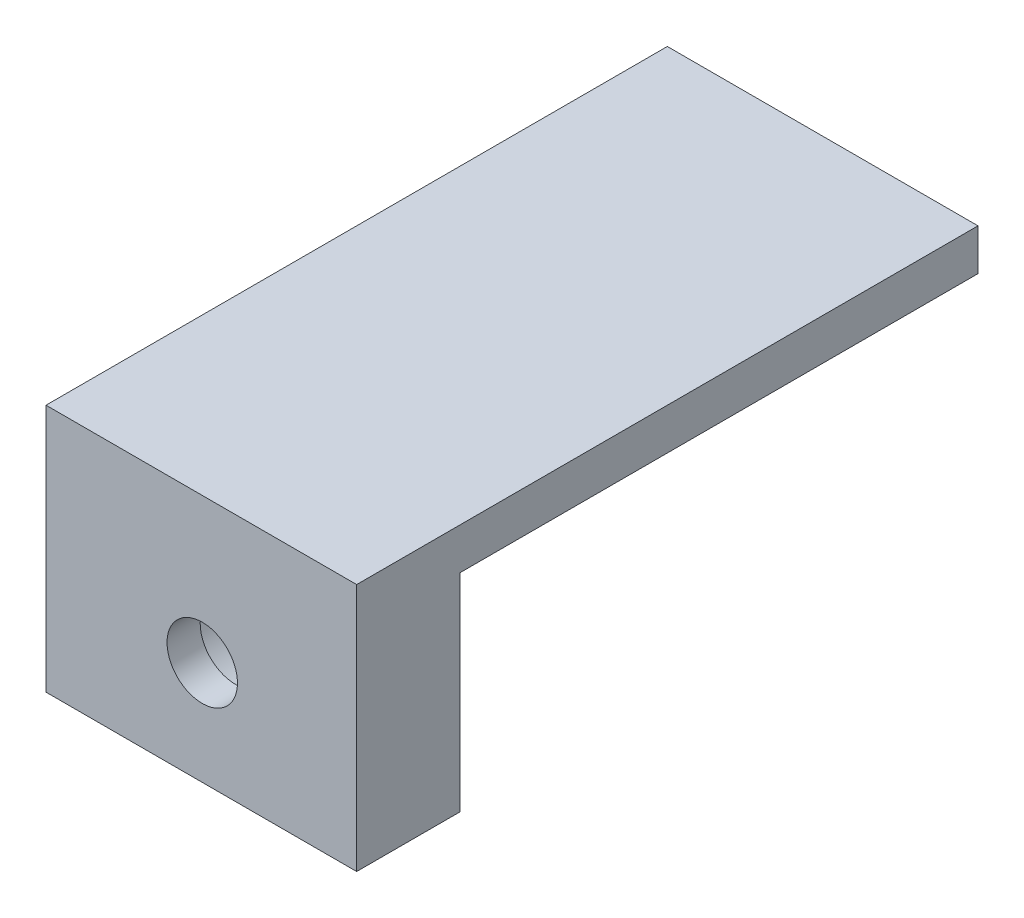
ISO-10303-21;
HEADER;
FILE_DESCRIPTION(('STEP AP214'),'2;1');
FILE_NAME('part.step','',(''),(''),'','','');
FILE_SCHEMA(('AUTOMOTIVE_DESIGN { 1 0 10303 214 1 1 1 1 }'));
ENDSEC;
DATA;
#1=APPLICATION_CONTEXT('core data for automotive mechanical design processes');
#2=APPLICATION_PROTOCOL_DEFINITION('international standard','automotive_design',2000,#1);
#3=PRODUCT_CONTEXT('',#1,'mechanical');
#4=PRODUCT('Part','Part','',(#3));
#5=PRODUCT_RELATED_PRODUCT_CATEGORY('part','',(#4));
#6=PRODUCT_DEFINITION_FORMATION('','',#4);
#7=PRODUCT_DEFINITION_CONTEXT('part definition',#1,'design');
#8=PRODUCT_DEFINITION('design','',#6,#7);
#9=PRODUCT_DEFINITION_SHAPE('','',#8);
#10=(LENGTH_UNIT() NAMED_UNIT(*) SI_UNIT(.MILLI.,.METRE.));
#11=(NAMED_UNIT(*) PLANE_ANGLE_UNIT() SI_UNIT($,.RADIAN.));
#12=(NAMED_UNIT(*) SI_UNIT($,.STERADIAN.) SOLID_ANGLE_UNIT());
#13=UNCERTAINTY_MEASURE_WITH_UNIT(LENGTH_MEASURE(1.E-05),#10,'distance_accuracy_value','');
#14=(GEOMETRIC_REPRESENTATION_CONTEXT(3) GLOBAL_UNCERTAINTY_ASSIGNED_CONTEXT((#13)) GLOBAL_UNIT_ASSIGNED_CONTEXT((#10,
#11,#12)) REPRESENTATION_CONTEXT('',''));
#15=CARTESIAN_POINT('',(0.,0.,0.));
#16=DIRECTION('',(0.,0.,1.));
#17=DIRECTION('',(1.,0.,0.));
#18=AXIS2_PLACEMENT_3D('',#15,#16,#17);
#19=CARTESIAN_POINT('',(0.,0.,0.));
#20=DIRECTION('',(0.,0.,-1.));
#21=DIRECTION('',(-1.,0.,0.));
#22=AXIS2_PLACEMENT_3D('',#19,#20,#21);
#23=PLANE('',#22);
#24=CARTESIAN_POINT('',(7.54432711559616,0.,0.));
#25=DIRECTION('',(0.,0.,-1.));
#26=DIRECTION('',(-1.,0.,0.));
#27=AXIS2_PLACEMENT_3D('',#24,#25,#26);
#28=CIRCLE('',#27,3.25);
#29=CARTESIAN_POINT('',(4.29432711559616,0.,0.));
#30=VERTEX_POINT('',#29);
#31=EDGE_CURVE('E244',#30,#30,#28,.T.);
#32=ORIENTED_EDGE('',*,*,#31,.F.);
#33=EDGE_LOOP('',(#32));
#34=FACE_BOUND('',#33,.T.);
#35=DIRECTION('',(-1.,0.,0.));
#36=VECTOR('',#35,1.);
#37=CARTESIAN_POINT('',(0.,5.,0.));
#38=LINE('',#37,#36);
#39=CARTESIAN_POINT('',(15.,5.,0.));
#40=VERTEX_POINT('',#39);
#41=CARTESIAN_POINT('',(0.,5.,0.));
#42=VERTEX_POINT('',#41);
#43=EDGE_CURVE('E52',#40,#42,#38,.T.);
#44=ORIENTED_EDGE('',*,*,#43,.F.);
#45=DIRECTION('',(0.,1.,0.));
#46=VECTOR('',#45,1.);
#47=CARTESIAN_POINT('',(15.,0.,0.));
#48=LINE('',#47,#46);
#49=CARTESIAN_POINT('',(15.,-5.,0.));
#50=VERTEX_POINT('',#49);
#51=EDGE_CURVE('E138',#50,#40,#48,.T.);
#52=ORIENTED_EDGE('',*,*,#51,.F.);
#53=DIRECTION('',(1.,0.,0.));
#54=VECTOR('',#53,1.);
#55=CARTESIAN_POINT('',(15.,-5.,0.));
#56=LINE('',#55,#54);
#57=CARTESIAN_POINT('',(0.,-5.,0.));
#58=VERTEX_POINT('',#57);
#59=EDGE_CURVE('E108',#58,#50,#56,.T.);
#60=ORIENTED_EDGE('',*,*,#59,.F.);
#61=DIRECTION('',(0.,-1.,0.));
#62=VECTOR('',#61,1.);
#63=CARTESIAN_POINT('',(0.,0.,0.));
#64=LINE('',#63,#62);
#65=EDGE_CURVE('E57',#42,#58,#64,.T.);
#66=ORIENTED_EDGE('',*,*,#65,.F.);
#67=EDGE_LOOP('',(#44,#52,#60,#66));
#68=FACE_BOUND('',#67,.T.);
#69=ADVANCED_FACE('F35',(#34,#68),#23,.T.);
#70=CARTESIAN_POINT('',(0.,0.,5.));
#71=DIRECTION('',(1.,0.,0.));
#72=DIRECTION('',(0.,0.,-1.));
#73=AXIS2_PLACEMENT_3D('',#70,#71,#72);
#74=PLANE('',#73);
#75=DIRECTION('',(0.,-1.,0.));
#76=VECTOR('',#75,1.);
#77=CARTESIAN_POINT('',(0.,0.,5.));
#78=LINE('',#77,#76);
#79=CARTESIAN_POINT('',(0.,7.,5.));
#80=VERTEX_POINT('',#79);
#81=CARTESIAN_POINT('',(0.,-5.,5.));
#82=VERTEX_POINT('',#81);
#83=EDGE_CURVE('E44',#80,#82,#78,.T.);
#84=ORIENTED_EDGE('',*,*,#83,.F.);
#85=DIRECTION('',(0.,0.,1.));
#86=VECTOR('',#85,1.);
#87=CARTESIAN_POINT('',(0.,7.,-25.));
#88=LINE('',#87,#86);
#89=CARTESIAN_POINT('',(0.,7.,-25.));
#90=VERTEX_POINT('',#89);
#91=EDGE_CURVE('E136',#90,#80,#88,.T.);
#92=ORIENTED_EDGE('',*,*,#91,.F.);
#93=DIRECTION('',(0.,1.,0.));
#94=VECTOR('',#93,1.);
#95=CARTESIAN_POINT('',(0.,5.,-25.));
#96=LINE('',#95,#94);
#97=CARTESIAN_POINT('',(0.,5.,-25.));
#98=VERTEX_POINT('',#97);
#99=EDGE_CURVE('E119',#98,#90,#96,.T.);
#100=ORIENTED_EDGE('',*,*,#99,.F.);
#101=DIRECTION('',(0.,0.,1.));
#102=VECTOR('',#101,1.);
#103=CARTESIAN_POINT('',(0.,5.,-25.));
#104=LINE('',#103,#102);
#105=EDGE_CURVE('E128',#98,#42,#104,.T.);
#106=ORIENTED_EDGE('',*,*,#105,.T.);
#107=ORIENTED_EDGE('',*,*,#65,.T.);
#108=DIRECTION('',(0.,0.,-1.));
#109=VECTOR('',#108,1.);
#110=CARTESIAN_POINT('',(0.,-5.,5.));
#111=LINE('',#110,#109);
#112=EDGE_CURVE('E104',#82,#58,#111,.T.);
#113=ORIENTED_EDGE('',*,*,#112,.F.);
#114=EDGE_LOOP('',(#84,#92,#100,#106,#107,#113));
#115=FACE_BOUND('',#114,.T.);
#116=ADVANCED_FACE('F37',(#115),#74,.F.);
#117=CARTESIAN_POINT('',(15.,0.,5.));
#118=DIRECTION('',(-1.,0.,0.));
#119=DIRECTION('',(0.,0.,1.));
#120=AXIS2_PLACEMENT_3D('',#117,#118,#119);
#121=PLANE('',#120);
#122=DIRECTION('',(0.,0.,1.));
#123=VECTOR('',#122,1.);
#124=CARTESIAN_POINT('',(15.,7.,-25.));
#125=LINE('',#124,#123);
#126=CARTESIAN_POINT('',(15.,7.,-25.));
#127=VERTEX_POINT('',#126);
#128=CARTESIAN_POINT('',(15.,7.,5.));
#129=VERTEX_POINT('',#128);
#130=EDGE_CURVE('E93',#127,#129,#125,.T.);
#131=ORIENTED_EDGE('',*,*,#130,.T.);
#132=DIRECTION('',(0.,1.,0.));
#133=VECTOR('',#132,1.);
#134=CARTESIAN_POINT('',(15.,0.,5.));
#135=LINE('',#134,#133);
#136=CARTESIAN_POINT('',(15.,-5.,5.));
#137=VERTEX_POINT('',#136);
#138=EDGE_CURVE('E11',#137,#129,#135,.T.);
#139=ORIENTED_EDGE('',*,*,#138,.F.);
#140=DIRECTION('',(0.,0.,1.));
#141=VECTOR('',#140,1.);
#142=CARTESIAN_POINT('',(15.,-5.,5.));
#143=LINE('',#142,#141);
#144=EDGE_CURVE('E90',#50,#137,#143,.T.);
#145=ORIENTED_EDGE('',*,*,#144,.F.);
#146=ORIENTED_EDGE('',*,*,#51,.T.);
#147=DIRECTION('',(0.,0.,1.));
#148=VECTOR('',#147,1.);
#149=CARTESIAN_POINT('',(15.,5.,-25.));
#150=LINE('',#149,#148);
#151=CARTESIAN_POINT('',(15.,5.,-25.));
#152=VERTEX_POINT('',#151);
#153=EDGE_CURVE('E132',#152,#40,#150,.T.);
#154=ORIENTED_EDGE('',*,*,#153,.F.);
#155=DIRECTION('',(0.,-1.,0.));
#156=VECTOR('',#155,1.);
#157=CARTESIAN_POINT('',(15.,5.,-25.));
#158=LINE('',#157,#156);
#159=EDGE_CURVE('E124',#127,#152,#158,.T.);
#160=ORIENTED_EDGE('',*,*,#159,.F.);
#161=EDGE_LOOP('',(#131,#139,#145,#146,#154,#160));
#162=FACE_BOUND('',#161,.T.);
#163=ADVANCED_FACE('F88',(#162),#121,.F.);
#164=CARTESIAN_POINT('',(0.,0.,5.));
#165=DIRECTION('',(0.,0.,-1.));
#166=DIRECTION('',(-1.,0.,0.));
#167=AXIS2_PLACEMENT_3D('',#164,#165,#166);
#168=PLANE('',#167);
#169=CARTESIAN_POINT('',(7.54432711559616,0.,5.));
#170=DIRECTION('',(0.,0.,-1.));
#171=DIRECTION('',(-1.,0.,0.));
#172=AXIS2_PLACEMENT_3D('',#169,#170,#171);
#173=CIRCLE('',#172,1.7);
#174=CARTESIAN_POINT('',(5.84432711559616,0.,5.));
#175=VERTEX_POINT('',#174);
#176=EDGE_CURVE('E39',#175,#175,#173,.T.);
#177=ORIENTED_EDGE('',*,*,#176,.T.);
#178=EDGE_LOOP('',(#177));
#179=FACE_BOUND('',#178,.T.);
#180=ORIENTED_EDGE('',*,*,#138,.T.);
#181=DIRECTION('',(-1.,0.,0.));
#182=VECTOR('',#181,1.);
#183=CARTESIAN_POINT('',(0.,7.,5.));
#184=LINE('',#183,#182);
#185=EDGE_CURVE('E117',#129,#80,#184,.T.);
#186=ORIENTED_EDGE('',*,*,#185,.T.);
#187=ORIENTED_EDGE('',*,*,#83,.T.);
#188=DIRECTION('',(-1.,0.,0.));
#189=VECTOR('',#188,1.);
#190=CARTESIAN_POINT('',(15.,-5.,5.));
#191=LINE('',#190,#189);
#192=EDGE_CURVE('E98',#137,#82,#191,.T.);
#193=ORIENTED_EDGE('',*,*,#192,.F.);
#194=EDGE_LOOP('',(#180,#186,#187,#193));
#195=FACE_BOUND('',#194,.T.);
#196=ADVANCED_FACE('F99',(#179,#195),#168,.F.);
#197=CARTESIAN_POINT('',(0.,7.,-25.));
#198=DIRECTION('',(0.,-1.,0.));
#199=DIRECTION('',(0.,0.,-1.));
#200=AXIS2_PLACEMENT_3D('',#197,#198,#199);
#201=PLANE('',#200);
#202=ORIENTED_EDGE('',*,*,#91,.T.);
#203=ORIENTED_EDGE('',*,*,#185,.F.);
#204=ORIENTED_EDGE('',*,*,#130,.F.);
#205=DIRECTION('',(1.,0.,0.));
#206=VECTOR('',#205,1.);
#207=CARTESIAN_POINT('',(0.,7.,-25.));
#208=LINE('',#207,#206);
#209=EDGE_CURVE('E122',#90,#127,#208,.T.);
#210=ORIENTED_EDGE('',*,*,#209,.F.);
#211=EDGE_LOOP('',(#202,#203,#204,#210));
#212=FACE_BOUND('',#211,.T.);
#213=ADVANCED_FACE('F150',(#212),#201,.F.);
#214=CARTESIAN_POINT('',(0.,5.,-25.));
#215=DIRECTION('',(0.,1.,0.));
#216=DIRECTION('',(0.,0.,1.));
#217=AXIS2_PLACEMENT_3D('',#214,#215,#216);
#218=PLANE('',#217);
#219=ORIENTED_EDGE('',*,*,#43,.T.);
#220=ORIENTED_EDGE('',*,*,#105,.F.);
#221=DIRECTION('',(-1.,0.,0.));
#222=VECTOR('',#221,1.);
#223=CARTESIAN_POINT('',(0.,5.,-25.));
#224=LINE('',#223,#222);
#225=EDGE_CURVE('E126',#152,#98,#224,.T.);
#226=ORIENTED_EDGE('',*,*,#225,.F.);
#227=ORIENTED_EDGE('',*,*,#153,.T.);
#228=EDGE_LOOP('',(#219,#220,#226,#227));
#229=FACE_BOUND('',#228,.T.);
#230=ADVANCED_FACE('F143',(#229),#218,.F.);
#231=CARTESIAN_POINT('',(0.,0.,-25.));
#232=DIRECTION('',(0.,0.,-1.));
#233=DIRECTION('',(-1.,0.,0.));
#234=AXIS2_PLACEMENT_3D('',#231,#232,#233);
#235=PLANE('',#234);
#236=ORIENTED_EDGE('',*,*,#99,.T.);
#237=ORIENTED_EDGE('',*,*,#209,.T.);
#238=ORIENTED_EDGE('',*,*,#159,.T.);
#239=ORIENTED_EDGE('',*,*,#225,.T.);
#240=EDGE_LOOP('',(#236,#237,#238,#239));
#241=FACE_BOUND('',#240,.T.);
#242=ADVANCED_FACE('F147',(#241),#235,.T.);
#243=CARTESIAN_POINT('',(0.,-5.,0.));
#244=DIRECTION('',(0.,1.,0.));
#245=DIRECTION('',(0.,0.,1.));
#246=AXIS2_PLACEMENT_3D('',#243,#244,#245);
#247=PLANE('',#246);
#248=ORIENTED_EDGE('',*,*,#144,.T.);
#249=ORIENTED_EDGE('',*,*,#192,.T.);
#250=ORIENTED_EDGE('',*,*,#112,.T.);
#251=ORIENTED_EDGE('',*,*,#59,.T.);
#252=EDGE_LOOP('',(#248,#249,#250,#251));
#253=FACE_BOUND('',#252,.T.);
#254=ADVANCED_FACE('F107',(#253),#247,.F.);
#255=CARTESIAN_POINT('',(7.54432711559616,0.,0.));
#256=DIRECTION('',(0.,0.,-1.));
#257=DIRECTION('',(-1.,0.,0.));
#258=AXIS2_PLACEMENT_3D('',#255,#256,#257);
#259=CYLINDRICAL_SURFACE('',#258,1.7);
#260=CARTESIAN_POINT('',(7.54432711559616,0.,3.4));
#261=DIRECTION('',(0.,0.,-1.));
#262=DIRECTION('',(-1.,0.,0.));
#263=AXIS2_PLACEMENT_3D('',#260,#261,#262);
#264=CIRCLE('',#263,1.7);
#265=CARTESIAN_POINT('',(5.84432711559616,0.,3.4));
#266=VERTEX_POINT('',#265);
#267=EDGE_CURVE('E111',#266,#266,#264,.T.);
#268=ORIENTED_EDGE('',*,*,#267,.T.);
#269=EDGE_LOOP('',(#268));
#270=FACE_BOUND('',#269,.T.);
#271=ORIENTED_EDGE('',*,*,#176,.F.);
#272=EDGE_LOOP('',(#271));
#273=FACE_BOUND('',#272,.T.);
#274=ADVANCED_FACE('F171',(#270,#273),#259,.F.);
#275=CARTESIAN_POINT('',(9.24432711559616,0.,3.4));
#276=DIRECTION('',(0.,0.,1.));
#277=DIRECTION('',(1.,0.,0.));
#278=AXIS2_PLACEMENT_3D('',#275,#276,#277);
#279=PLANE('',#278);
#280=ORIENTED_EDGE('',*,*,#267,.F.);
#281=EDGE_LOOP('',(#280));
#282=FACE_BOUND('',#281,.T.);
#283=CARTESIAN_POINT('',(7.54432711559616,0.,3.4));
#284=DIRECTION('',(0.,0.,-1.));
#285=DIRECTION('',(-1.,0.,0.));
#286=AXIS2_PLACEMENT_3D('',#283,#284,#285);
#287=CIRCLE('',#286,3.25);
#288=CARTESIAN_POINT('',(4.29432711559616,0.,3.4));
#289=VERTEX_POINT('',#288);
#290=EDGE_CURVE('E242',#289,#289,#287,.T.);
#291=ORIENTED_EDGE('',*,*,#290,.T.);
#292=EDGE_LOOP('',(#291));
#293=FACE_BOUND('',#292,.T.);
#294=ADVANCED_FACE('F173',(#282,#293),#279,.F.);
#295=CARTESIAN_POINT('',(7.54432711559616,0.,0.));
#296=DIRECTION('',(0.,0.,-1.));
#297=DIRECTION('',(-1.,0.,0.));
#298=AXIS2_PLACEMENT_3D('',#295,#296,#297);
#299=CYLINDRICAL_SURFACE('',#298,3.25);
#300=ORIENTED_EDGE('',*,*,#290,.F.);
#301=EDGE_LOOP('',(#300));
#302=FACE_BOUND('',#301,.T.);
#303=ORIENTED_EDGE('',*,*,#31,.T.);
#304=EDGE_LOOP('',(#303));
#305=FACE_BOUND('',#304,.T.);
#306=ADVANCED_FACE('F180',(#302,#305),#299,.F.);
#307=CLOSED_SHELL('',(#69,#116,#163,#196,#213,#230,#242,#254,#274,#294,#306));
#308=MANIFOLD_SOLID_BREP('B2',#307);
#309=ADVANCED_BREP_SHAPE_REPRESENTATION('',(#18,#308),#14);
#310=SHAPE_DEFINITION_REPRESENTATION(#9,#309);
ENDSEC;
END-ISO-10303-21;
